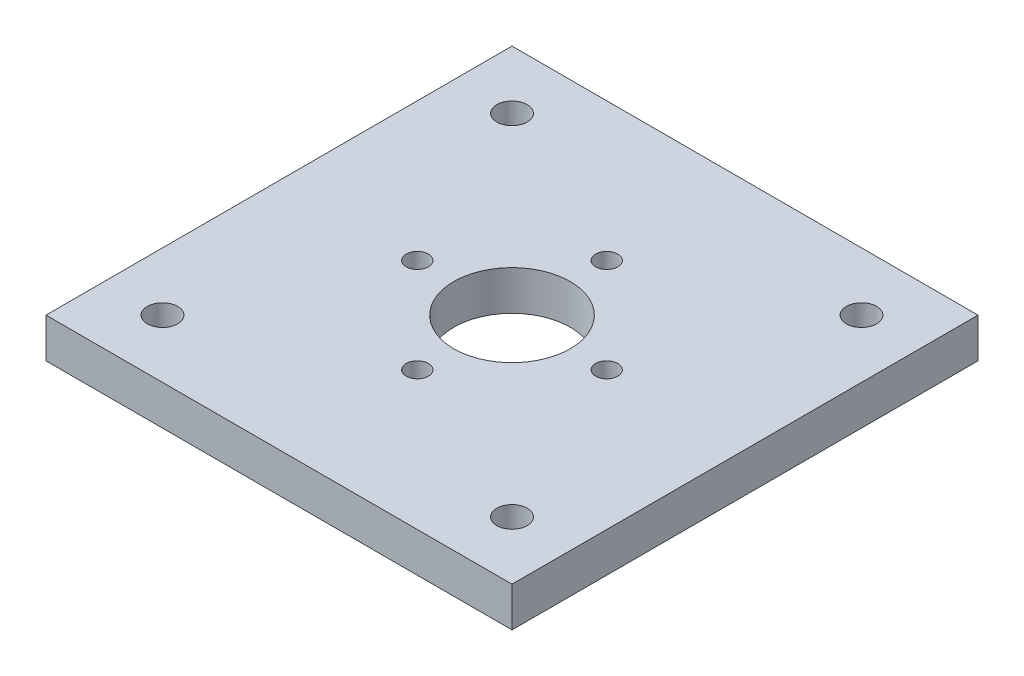
ISO-10303-21;
HEADER;
FILE_DESCRIPTION(('STEP AP214'),'2;1');
FILE_NAME('part.step','',(''),(''),'','','');
FILE_SCHEMA(('AUTOMOTIVE_DESIGN { 1 0 10303 214 1 1 1 1 }'));
ENDSEC;
DATA;
#1=APPLICATION_CONTEXT('core data for automotive mechanical design processes');
#2=APPLICATION_PROTOCOL_DEFINITION('international standard','automotive_design',2000,#1);
#3=PRODUCT_CONTEXT('',#1,'mechanical');
#4=PRODUCT('Part','Part','',(#3));
#5=PRODUCT_RELATED_PRODUCT_CATEGORY('part','',(#4));
#6=PRODUCT_DEFINITION_FORMATION('','',#4);
#7=PRODUCT_DEFINITION_CONTEXT('part definition',#1,'design');
#8=PRODUCT_DEFINITION('design','',#6,#7);
#9=PRODUCT_DEFINITION_SHAPE('','',#8);
#10=(LENGTH_UNIT() NAMED_UNIT(*) SI_UNIT(.MILLI.,.METRE.));
#11=(NAMED_UNIT(*) PLANE_ANGLE_UNIT() SI_UNIT($,.RADIAN.));
#12=(NAMED_UNIT(*) SI_UNIT($,.STERADIAN.) SOLID_ANGLE_UNIT());
#13=UNCERTAINTY_MEASURE_WITH_UNIT(LENGTH_MEASURE(1.E-05),#10,'distance_accuracy_value','');
#14=(GEOMETRIC_REPRESENTATION_CONTEXT(3) GLOBAL_UNCERTAINTY_ASSIGNED_CONTEXT((#13)) GLOBAL_UNIT_ASSIGNED_CONTEXT((#10,
#11,#12)) REPRESENTATION_CONTEXT('',''));
#15=CARTESIAN_POINT('',(0.,0.,0.));
#16=DIRECTION('',(0.,0.,1.));
#17=DIRECTION('',(1.,0.,0.));
#18=AXIS2_PLACEMENT_3D('',#15,#16,#17);
#19=CARTESIAN_POINT('',(0.,34.,0.));
#20=DIRECTION('',(0.,1.,0.));
#21=DIRECTION('',(0.,0.,1.));
#22=AXIS2_PLACEMENT_3D('',#19,#20,#21);
#23=PLANE('',#22);
#24=CARTESIAN_POINT('',(0.,34.,81.2999999999999));
#25=DIRECTION('',(0.,1.,0.));
#26=DIRECTION('',(0.,0.,-1.));
#27=AXIS2_PLACEMENT_3D('',#24,#25,#26);
#28=CIRCLE('',#27,9.5);
#29=CARTESIAN_POINT('',(0.,34.,71.7999999999999));
#30=VERTEX_POINT('',#29);
#31=EDGE_CURVE('E159',#30,#30,#28,.T.);
#32=ORIENTED_EDGE('',*,*,#31,.F.);
#33=EDGE_LOOP('',(#32));
#34=FACE_BOUND('',#33,.T.);
#35=CARTESIAN_POINT('',(0.,34.,-81.3));
#36=DIRECTION('',(0.,1.,0.));
#37=DIRECTION('',(0.,0.,1.));
#38=AXIS2_PLACEMENT_3D('',#35,#36,#37);
#39=CIRCLE('',#38,9.5);
#40=CARTESIAN_POINT('',(0.,34.,-71.8));
#41=VERTEX_POINT('',#40);
#42=EDGE_CURVE('E147',#41,#41,#39,.T.);
#43=ORIENTED_EDGE('',*,*,#42,.F.);
#44=EDGE_LOOP('',(#43));
#45=FACE_BOUND('',#44,.T.);
#46=CARTESIAN_POINT('',(150.,34.,-150.));
#47=DIRECTION('',(0.,1.,0.));
#48=DIRECTION('',(0.,0.,-1.));
#49=AXIS2_PLACEMENT_3D('',#46,#47,#48);
#50=CIRCLE('',#49,13.);
#51=CARTESIAN_POINT('',(150.,34.,-163.));
#52=VERTEX_POINT('',#51);
#53=EDGE_CURVE('E135',#52,#52,#50,.T.);
#54=ORIENTED_EDGE('',*,*,#53,.F.);
#55=EDGE_LOOP('',(#54));
#56=FACE_BOUND('',#55,.T.);
#57=CARTESIAN_POINT('',(-150.,34.,150.));
#58=DIRECTION('',(0.,1.,0.));
#59=DIRECTION('',(0.,0.,1.));
#60=AXIS2_PLACEMENT_3D('',#57,#58,#59);
#61=CIRCLE('',#60,13.);
#62=CARTESIAN_POINT('',(-150.,34.,163.));
#63=VERTEX_POINT('',#62);
#64=EDGE_CURVE('E123',#63,#63,#61,.T.);
#65=ORIENTED_EDGE('',*,*,#64,.F.);
#66=EDGE_LOOP('',(#65));
#67=FACE_BOUND('',#66,.T.);
#68=DIRECTION('',(0.,0.,-1.));
#69=VECTOR('',#68,1.);
#70=CARTESIAN_POINT('',(200.,34.,-200.));
#71=LINE('',#70,#69);
#72=CARTESIAN_POINT('',(200.,34.,200.));
#73=VERTEX_POINT('',#72);
#74=CARTESIAN_POINT('',(200.,34.,-200.));
#75=VERTEX_POINT('',#74);
#76=EDGE_CURVE('E93',#73,#75,#71,.T.);
#77=ORIENTED_EDGE('',*,*,#76,.T.);
#78=DIRECTION('',(-1.,0.,0.));
#79=VECTOR('',#78,1.);
#80=CARTESIAN_POINT('',(-200.,34.,-200.));
#81=LINE('',#80,#79);
#82=CARTESIAN_POINT('',(-200.,34.,-200.));
#83=VERTEX_POINT('',#82);
#84=EDGE_CURVE('E88',#75,#83,#81,.T.);
#85=ORIENTED_EDGE('',*,*,#84,.T.);
#86=DIRECTION('',(0.,0.,1.));
#87=VECTOR('',#86,1.);
#88=CARTESIAN_POINT('',(-200.,34.,-200.));
#89=LINE('',#88,#87);
#90=CARTESIAN_POINT('',(-200.,34.,200.));
#91=VERTEX_POINT('',#90);
#92=EDGE_CURVE('E91',#83,#91,#89,.T.);
#93=ORIENTED_EDGE('',*,*,#92,.T.);
#94=DIRECTION('',(1.,0.,0.));
#95=VECTOR('',#94,1.);
#96=CARTESIAN_POINT('',(-200.,34.,200.));
#97=LINE('',#96,#95);
#98=EDGE_CURVE('E58',#91,#73,#97,.T.);
#99=ORIENTED_EDGE('',*,*,#98,.T.);
#100=EDGE_LOOP('',(#77,#85,#93,#99));
#101=FACE_BOUND('',#100,.T.);
#102=CARTESIAN_POINT('',(-150.,34.,-150.));
#103=DIRECTION('',(0.,1.,0.));
#104=DIRECTION('',(0.,0.,1.));
#105=AXIS2_PLACEMENT_3D('',#102,#103,#104);
#106=CIRCLE('',#105,13.);
#107=CARTESIAN_POINT('',(-150.,34.,-137.));
#108=VERTEX_POINT('',#107);
#109=EDGE_CURVE('E108',#108,#108,#106,.T.);
#110=ORIENTED_EDGE('',*,*,#109,.F.);
#111=EDGE_LOOP('',(#110));
#112=FACE_BOUND('',#111,.T.);
#113=CARTESIAN_POINT('',(150.,34.,150.));
#114=DIRECTION('',(0.,1.,0.));
#115=DIRECTION('',(0.,0.,-1.));
#116=AXIS2_PLACEMENT_3D('',#113,#114,#115);
#117=CIRCLE('',#116,13.);
#118=CARTESIAN_POINT('',(150.,34.,137.));
#119=VERTEX_POINT('',#118);
#120=EDGE_CURVE('E129',#119,#119,#117,.T.);
#121=ORIENTED_EDGE('',*,*,#120,.F.);
#122=EDGE_LOOP('',(#121));
#123=FACE_BOUND('',#122,.T.);
#124=CARTESIAN_POINT('',(0.,34.,0.));
#125=DIRECTION('',(0.,1.,0.));
#126=DIRECTION('',(0.,0.,1.));
#127=AXIS2_PLACEMENT_3D('',#124,#125,#126);
#128=CIRCLE('',#127,50.);
#129=CARTESIAN_POINT('',(0.,34.,50.));
#130=VERTEX_POINT('',#129);
#131=EDGE_CURVE('E141',#130,#130,#128,.T.);
#132=ORIENTED_EDGE('',*,*,#131,.F.);
#133=EDGE_LOOP('',(#132));
#134=FACE_BOUND('',#133,.T.);
#135=CARTESIAN_POINT('',(-81.3,34.,0.));
#136=DIRECTION('',(0.,1.,0.));
#137=DIRECTION('',(0.,0.,1.));
#138=AXIS2_PLACEMENT_3D('',#135,#136,#137);
#139=CIRCLE('',#138,9.49999999999999);
#140=CARTESIAN_POINT('',(-81.3,34.,9.49999999999999));
#141=VERTEX_POINT('',#140);
#142=EDGE_CURVE('E153',#141,#141,#139,.T.);
#143=ORIENTED_EDGE('',*,*,#142,.F.);
#144=EDGE_LOOP('',(#143));
#145=FACE_BOUND('',#144,.T.);
#146=CARTESIAN_POINT('',(81.2999999999999,34.,0.));
#147=DIRECTION('',(0.,1.,0.));
#148=DIRECTION('',(0.,0.,-1.));
#149=AXIS2_PLACEMENT_3D('',#146,#147,#148);
#150=CIRCLE('',#149,9.49999999999999);
#151=CARTESIAN_POINT('',(81.2999999999999,34.,-9.49999999999999));
#152=VERTEX_POINT('',#151);
#153=EDGE_CURVE('E165',#152,#152,#150,.T.);
#154=ORIENTED_EDGE('',*,*,#153,.F.);
#155=EDGE_LOOP('',(#154));
#156=FACE_BOUND('',#155,.T.);
#157=ADVANCED_FACE('F41',(#34,#45,#56,#67,#101,#112,#123,#134,#145,#156),#23,.T.);
#158=CARTESIAN_POINT('',(0.,0.,0.));
#159=DIRECTION('',(0.,1.,0.));
#160=DIRECTION('',(0.,0.,1.));
#161=AXIS2_PLACEMENT_3D('',#158,#159,#160);
#162=PLANE('',#161);
#163=DIRECTION('',(0.,0.,-1.));
#164=VECTOR('',#163,1.);
#165=CARTESIAN_POINT('',(200.,0.,-200.));
#166=LINE('',#165,#164);
#167=CARTESIAN_POINT('',(200.,0.,200.));
#168=VERTEX_POINT('',#167);
#169=CARTESIAN_POINT('',(200.,0.,-200.));
#170=VERTEX_POINT('',#169);
#171=EDGE_CURVE('E105',#168,#170,#166,.T.);
#172=ORIENTED_EDGE('',*,*,#171,.F.);
#173=DIRECTION('',(1.,0.,0.));
#174=VECTOR('',#173,1.);
#175=CARTESIAN_POINT('',(-200.,0.,200.));
#176=LINE('',#175,#174);
#177=CARTESIAN_POINT('',(-200.,0.,200.));
#178=VERTEX_POINT('',#177);
#179=EDGE_CURVE('E81',#178,#168,#176,.T.);
#180=ORIENTED_EDGE('',*,*,#179,.F.);
#181=DIRECTION('',(0.,0.,1.));
#182=VECTOR('',#181,1.);
#183=CARTESIAN_POINT('',(-200.,0.,-200.));
#184=LINE('',#183,#182);
#185=CARTESIAN_POINT('',(-200.,0.,-200.));
#186=VERTEX_POINT('',#185);
#187=EDGE_CURVE('E75',#186,#178,#184,.T.);
#188=ORIENTED_EDGE('',*,*,#187,.F.);
#189=DIRECTION('',(-1.,0.,0.));
#190=VECTOR('',#189,1.);
#191=CARTESIAN_POINT('',(-200.,0.,-200.));
#192=LINE('',#191,#190);
#193=EDGE_CURVE('E97',#170,#186,#192,.T.);
#194=ORIENTED_EDGE('',*,*,#193,.F.);
#195=EDGE_LOOP('',(#172,#180,#188,#194));
#196=FACE_BOUND('',#195,.T.);
#197=CARTESIAN_POINT('',(-150.,0.,-150.));
#198=DIRECTION('',(0.,1.,0.));
#199=DIRECTION('',(0.,0.,1.));
#200=AXIS2_PLACEMENT_3D('',#197,#198,#199);
#201=CIRCLE('',#200,13.);
#202=CARTESIAN_POINT('',(-150.,0.,-137.));
#203=VERTEX_POINT('',#202);
#204=EDGE_CURVE('E120',#203,#203,#201,.T.);
#205=ORIENTED_EDGE('',*,*,#204,.T.);
#206=EDGE_LOOP('',(#205));
#207=FACE_BOUND('',#206,.T.);
#208=CARTESIAN_POINT('',(-150.,0.,150.));
#209=DIRECTION('',(0.,1.,0.));
#210=DIRECTION('',(0.,0.,1.));
#211=AXIS2_PLACEMENT_3D('',#208,#209,#210);
#212=CIRCLE('',#211,13.);
#213=CARTESIAN_POINT('',(-150.,0.,163.));
#214=VERTEX_POINT('',#213);
#215=EDGE_CURVE('E126',#214,#214,#212,.T.);
#216=ORIENTED_EDGE('',*,*,#215,.T.);
#217=EDGE_LOOP('',(#216));
#218=FACE_BOUND('',#217,.T.);
#219=CARTESIAN_POINT('',(150.,0.,150.));
#220=DIRECTION('',(0.,1.,0.));
#221=DIRECTION('',(0.,0.,-1.));
#222=AXIS2_PLACEMENT_3D('',#219,#220,#221);
#223=CIRCLE('',#222,13.);
#224=CARTESIAN_POINT('',(150.,0.,137.));
#225=VERTEX_POINT('',#224);
#226=EDGE_CURVE('E132',#225,#225,#223,.T.);
#227=ORIENTED_EDGE('',*,*,#226,.T.);
#228=EDGE_LOOP('',(#227));
#229=FACE_BOUND('',#228,.T.);
#230=CARTESIAN_POINT('',(150.,0.,-150.));
#231=DIRECTION('',(0.,1.,0.));
#232=DIRECTION('',(0.,0.,-1.));
#233=AXIS2_PLACEMENT_3D('',#230,#231,#232);
#234=CIRCLE('',#233,13.);
#235=CARTESIAN_POINT('',(150.,0.,-163.));
#236=VERTEX_POINT('',#235);
#237=EDGE_CURVE('E138',#236,#236,#234,.T.);
#238=ORIENTED_EDGE('',*,*,#237,.T.);
#239=EDGE_LOOP('',(#238));
#240=FACE_BOUND('',#239,.T.);
#241=CARTESIAN_POINT('',(0.,0.,0.));
#242=DIRECTION('',(0.,1.,0.));
#243=DIRECTION('',(0.,0.,1.));
#244=AXIS2_PLACEMENT_3D('',#241,#242,#243);
#245=CIRCLE('',#244,50.);
#246=CARTESIAN_POINT('',(0.,0.,50.));
#247=VERTEX_POINT('',#246);
#248=EDGE_CURVE('E144',#247,#247,#245,.T.);
#249=ORIENTED_EDGE('',*,*,#248,.T.);
#250=EDGE_LOOP('',(#249));
#251=FACE_BOUND('',#250,.T.);
#252=CARTESIAN_POINT('',(0.,0.,-81.3));
#253=DIRECTION('',(0.,1.,0.));
#254=DIRECTION('',(0.,0.,1.));
#255=AXIS2_PLACEMENT_3D('',#252,#253,#254);
#256=CIRCLE('',#255,9.5);
#257=CARTESIAN_POINT('',(0.,0.,-71.8));
#258=VERTEX_POINT('',#257);
#259=EDGE_CURVE('E150',#258,#258,#256,.T.);
#260=ORIENTED_EDGE('',*,*,#259,.T.);
#261=EDGE_LOOP('',(#260));
#262=FACE_BOUND('',#261,.T.);
#263=CARTESIAN_POINT('',(-81.3,0.,0.));
#264=DIRECTION('',(0.,1.,0.));
#265=DIRECTION('',(0.,0.,1.));
#266=AXIS2_PLACEMENT_3D('',#263,#264,#265);
#267=CIRCLE('',#266,9.49999999999999);
#268=CARTESIAN_POINT('',(-81.3,0.,9.49999999999999));
#269=VERTEX_POINT('',#268);
#270=EDGE_CURVE('E156',#269,#269,#267,.T.);
#271=ORIENTED_EDGE('',*,*,#270,.T.);
#272=EDGE_LOOP('',(#271));
#273=FACE_BOUND('',#272,.T.);
#274=CARTESIAN_POINT('',(0.,0.,81.2999999999999));
#275=DIRECTION('',(0.,1.,0.));
#276=DIRECTION('',(0.,0.,-1.));
#277=AXIS2_PLACEMENT_3D('',#274,#275,#276);
#278=CIRCLE('',#277,9.5);
#279=CARTESIAN_POINT('',(0.,0.,71.7999999999999));
#280=VERTEX_POINT('',#279);
#281=EDGE_CURVE('E162',#280,#280,#278,.T.);
#282=ORIENTED_EDGE('',*,*,#281,.T.);
#283=EDGE_LOOP('',(#282));
#284=FACE_BOUND('',#283,.T.);
#285=CARTESIAN_POINT('',(81.2999999999999,0.,0.));
#286=DIRECTION('',(0.,1.,0.));
#287=DIRECTION('',(0.,0.,-1.));
#288=AXIS2_PLACEMENT_3D('',#285,#286,#287);
#289=CIRCLE('',#288,9.49999999999999);
#290=CARTESIAN_POINT('',(81.2999999999999,0.,-9.49999999999999));
#291=VERTEX_POINT('',#290);
#292=EDGE_CURVE('E168',#291,#291,#289,.T.);
#293=ORIENTED_EDGE('',*,*,#292,.T.);
#294=EDGE_LOOP('',(#293));
#295=FACE_BOUND('',#294,.T.);
#296=ADVANCED_FACE('F116',(#196,#207,#218,#229,#240,#251,#262,#273,#284,#295),#162,.F.);
#297=CARTESIAN_POINT('',(200.,34.,-200.));
#298=DIRECTION('',(-1.,0.,0.));
#299=DIRECTION('',(0.,0.,1.));
#300=AXIS2_PLACEMENT_3D('',#297,#298,#299);
#301=PLANE('',#300);
#302=ORIENTED_EDGE('',*,*,#171,.T.);
#303=DIRECTION('',(0.,-1.,0.));
#304=VECTOR('',#303,1.);
#305=CARTESIAN_POINT('',(200.,34.,-200.));
#306=LINE('',#305,#304);
#307=EDGE_CURVE('E11',#75,#170,#306,.T.);
#308=ORIENTED_EDGE('',*,*,#307,.F.);
#309=ORIENTED_EDGE('',*,*,#76,.F.);
#310=DIRECTION('',(0.,-1.,0.));
#311=VECTOR('',#310,1.);
#312=CARTESIAN_POINT('',(200.,34.,200.));
#313=LINE('',#312,#311);
#314=EDGE_CURVE('E101',#73,#168,#313,.T.);
#315=ORIENTED_EDGE('',*,*,#314,.T.);
#316=EDGE_LOOP('',(#302,#308,#309,#315));
#317=FACE_BOUND('',#316,.T.);
#318=ADVANCED_FACE('F43',(#317),#301,.F.);
#319=CARTESIAN_POINT('',(-200.,34.,-200.));
#320=DIRECTION('',(0.,0.,1.));
#321=DIRECTION('',(1.,0.,0.));
#322=AXIS2_PLACEMENT_3D('',#319,#320,#321);
#323=PLANE('',#322);
#324=ORIENTED_EDGE('',*,*,#193,.T.);
#325=DIRECTION('',(0.,-1.,0.));
#326=VECTOR('',#325,1.);
#327=CARTESIAN_POINT('',(-200.,34.,-200.));
#328=LINE('',#327,#326);
#329=EDGE_CURVE('E50',#83,#186,#328,.T.);
#330=ORIENTED_EDGE('',*,*,#329,.F.);
#331=ORIENTED_EDGE('',*,*,#84,.F.);
#332=ORIENTED_EDGE('',*,*,#307,.T.);
#333=EDGE_LOOP('',(#324,#330,#331,#332));
#334=FACE_BOUND('',#333,.T.);
#335=ADVANCED_FACE('F96',(#334),#323,.F.);
#336=CARTESIAN_POINT('',(-200.,34.,-200.));
#337=DIRECTION('',(1.,0.,0.));
#338=DIRECTION('',(0.,0.,-1.));
#339=AXIS2_PLACEMENT_3D('',#336,#337,#338);
#340=PLANE('',#339);
#341=ORIENTED_EDGE('',*,*,#187,.T.);
#342=DIRECTION('',(0.,-1.,0.));
#343=VECTOR('',#342,1.);
#344=CARTESIAN_POINT('',(-200.,34.,200.));
#345=LINE('',#344,#343);
#346=EDGE_CURVE('E98',#91,#178,#345,.T.);
#347=ORIENTED_EDGE('',*,*,#346,.F.);
#348=ORIENTED_EDGE('',*,*,#92,.F.);
#349=ORIENTED_EDGE('',*,*,#329,.T.);
#350=EDGE_LOOP('',(#341,#347,#348,#349));
#351=FACE_BOUND('',#350,.T.);
#352=ADVANCED_FACE('F99',(#351),#340,.F.);
#353=CARTESIAN_POINT('',(-200.,34.,200.));
#354=DIRECTION('',(0.,0.,-1.));
#355=DIRECTION('',(-1.,0.,0.));
#356=AXIS2_PLACEMENT_3D('',#353,#354,#355);
#357=PLANE('',#356);
#358=ORIENTED_EDGE('',*,*,#179,.T.);
#359=ORIENTED_EDGE('',*,*,#314,.F.);
#360=ORIENTED_EDGE('',*,*,#98,.F.);
#361=ORIENTED_EDGE('',*,*,#346,.T.);
#362=EDGE_LOOP('',(#358,#359,#360,#361));
#363=FACE_BOUND('',#362,.T.);
#364=ADVANCED_FACE('F113',(#363),#357,.F.);
#365=CARTESIAN_POINT('',(-150.,34.,-150.));
#366=DIRECTION('',(0.,-1.,0.));
#367=DIRECTION('',(0.,0.,-1.));
#368=AXIS2_PLACEMENT_3D('',#365,#366,#367);
#369=CYLINDRICAL_SURFACE('',#368,13.);
#370=ORIENTED_EDGE('',*,*,#109,.T.);
#371=EDGE_LOOP('',(#370));
#372=FACE_BOUND('',#371,.T.);
#373=ORIENTED_EDGE('',*,*,#204,.F.);
#374=EDGE_LOOP('',(#373));
#375=FACE_BOUND('',#374,.T.);
#376=ADVANCED_FACE('F187',(#372,#375),#369,.F.);
#377=CARTESIAN_POINT('',(-150.,34.,150.));
#378=DIRECTION('',(0.,-1.,0.));
#379=DIRECTION('',(0.,0.,-1.));
#380=AXIS2_PLACEMENT_3D('',#377,#378,#379);
#381=CYLINDRICAL_SURFACE('',#380,13.);
#382=ORIENTED_EDGE('',*,*,#64,.T.);
#383=EDGE_LOOP('',(#382));
#384=FACE_BOUND('',#383,.T.);
#385=ORIENTED_EDGE('',*,*,#215,.F.);
#386=EDGE_LOOP('',(#385));
#387=FACE_BOUND('',#386,.T.);
#388=ADVANCED_FACE('F211',(#384,#387),#381,.F.);
#389=CARTESIAN_POINT('',(150.,34.,150.));
#390=DIRECTION('',(0.,-1.,0.));
#391=DIRECTION('',(0.,0.,-1.));
#392=AXIS2_PLACEMENT_3D('',#389,#390,#391);
#393=CYLINDRICAL_SURFACE('',#392,13.);
#394=ORIENTED_EDGE('',*,*,#120,.T.);
#395=EDGE_LOOP('',(#394));
#396=FACE_BOUND('',#395,.T.);
#397=ORIENTED_EDGE('',*,*,#226,.F.);
#398=EDGE_LOOP('',(#397));
#399=FACE_BOUND('',#398,.T.);
#400=ADVANCED_FACE('F218',(#396,#399),#393,.F.);
#401=CARTESIAN_POINT('',(150.,34.,-150.));
#402=DIRECTION('',(0.,-1.,0.));
#403=DIRECTION('',(0.,0.,-1.));
#404=AXIS2_PLACEMENT_3D('',#401,#402,#403);
#405=CYLINDRICAL_SURFACE('',#404,13.);
#406=ORIENTED_EDGE('',*,*,#53,.T.);
#407=EDGE_LOOP('',(#406));
#408=FACE_BOUND('',#407,.T.);
#409=ORIENTED_EDGE('',*,*,#237,.F.);
#410=EDGE_LOOP('',(#409));
#411=FACE_BOUND('',#410,.T.);
#412=ADVANCED_FACE('F225',(#408,#411),#405,.F.);
#413=CARTESIAN_POINT('',(0.,34.,0.));
#414=DIRECTION('',(0.,-1.,0.));
#415=DIRECTION('',(0.,0.,-1.));
#416=AXIS2_PLACEMENT_3D('',#413,#414,#415);
#417=CYLINDRICAL_SURFACE('',#416,50.);
#418=ORIENTED_EDGE('',*,*,#131,.T.);
#419=EDGE_LOOP('',(#418));
#420=FACE_BOUND('',#419,.T.);
#421=ORIENTED_EDGE('',*,*,#248,.F.);
#422=EDGE_LOOP('',(#421));
#423=FACE_BOUND('',#422,.T.);
#424=ADVANCED_FACE('F233',(#420,#423),#417,.F.);
#425=CARTESIAN_POINT('',(0.,34.,-81.3));
#426=DIRECTION('',(0.,-1.,0.));
#427=DIRECTION('',(0.,0.,-1.));
#428=AXIS2_PLACEMENT_3D('',#425,#426,#427);
#429=CYLINDRICAL_SURFACE('',#428,9.5);
#430=ORIENTED_EDGE('',*,*,#42,.T.);
#431=EDGE_LOOP('',(#430));
#432=FACE_BOUND('',#431,.T.);
#433=ORIENTED_EDGE('',*,*,#259,.F.);
#434=EDGE_LOOP('',(#433));
#435=FACE_BOUND('',#434,.T.);
#436=ADVANCED_FACE('F242',(#432,#435),#429,.F.);
#437=CARTESIAN_POINT('',(-81.3,34.,0.));
#438=DIRECTION('',(0.,-1.,0.));
#439=DIRECTION('',(0.,0.,-1.));
#440=AXIS2_PLACEMENT_3D('',#437,#438,#439);
#441=CYLINDRICAL_SURFACE('',#440,9.49999999999999);
#442=ORIENTED_EDGE('',*,*,#142,.T.);
#443=EDGE_LOOP('',(#442));
#444=FACE_BOUND('',#443,.T.);
#445=ORIENTED_EDGE('',*,*,#270,.F.);
#446=EDGE_LOOP('',(#445));
#447=FACE_BOUND('',#446,.T.);
#448=ADVANCED_FACE('F251',(#444,#447),#441,.F.);
#449=CARTESIAN_POINT('',(0.,34.,81.2999999999999));
#450=DIRECTION('',(0.,-1.,0.));
#451=DIRECTION('',(0.,0.,-1.));
#452=AXIS2_PLACEMENT_3D('',#449,#450,#451);
#453=CYLINDRICAL_SURFACE('',#452,9.5);
#454=ORIENTED_EDGE('',*,*,#31,.T.);
#455=EDGE_LOOP('',(#454));
#456=FACE_BOUND('',#455,.T.);
#457=ORIENTED_EDGE('',*,*,#281,.F.);
#458=EDGE_LOOP('',(#457));
#459=FACE_BOUND('',#458,.T.);
#460=ADVANCED_FACE('F258',(#456,#459),#453,.F.);
#461=CARTESIAN_POINT('',(81.2999999999999,34.,0.));
#462=DIRECTION('',(0.,-1.,0.));
#463=DIRECTION('',(0.,0.,-1.));
#464=AXIS2_PLACEMENT_3D('',#461,#462,#463);
#465=CYLINDRICAL_SURFACE('',#464,9.49999999999999);
#466=ORIENTED_EDGE('',*,*,#153,.T.);
#467=EDGE_LOOP('',(#466));
#468=FACE_BOUND('',#467,.T.);
#469=ORIENTED_EDGE('',*,*,#292,.F.);
#470=EDGE_LOOP('',(#469));
#471=FACE_BOUND('',#470,.T.);
#472=ADVANCED_FACE('F174',(#468,#471),#465,.F.);
#473=CLOSED_SHELL('',(#157,#296,#318,#335,#352,#364,#376,#388,#400,#412,#424,#436,#448,#460,#472));
#474=MANIFOLD_SOLID_BREP('B2',#473);
#475=ADVANCED_BREP_SHAPE_REPRESENTATION('',(#18,#474),#14);
#476=SHAPE_DEFINITION_REPRESENTATION(#9,#475);
ENDSEC;
END-ISO-10303-21;
